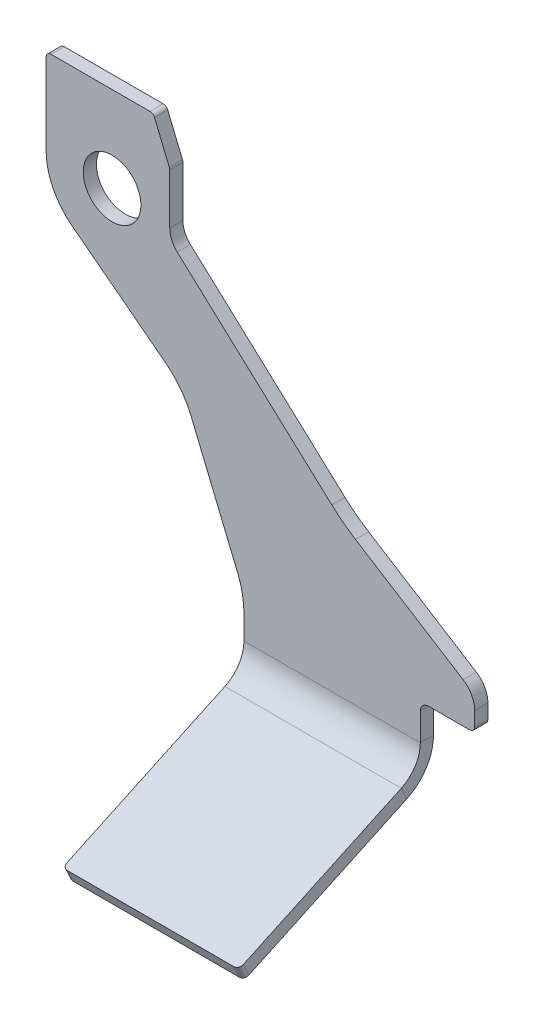
ISO-10303-21;
HEADER;
FILE_DESCRIPTION(('STEP AP214'),'2;1');
FILE_NAME('part.step','',(''),(''),'','','');
FILE_SCHEMA(('AUTOMOTIVE_DESIGN { 1 0 10303 214 1 1 1 1 }'));
ENDSEC;
DATA;
#1=APPLICATION_CONTEXT('core data for automotive mechanical design processes');
#2=APPLICATION_PROTOCOL_DEFINITION('international standard','automotive_design',2000,#1);
#3=PRODUCT_CONTEXT('',#1,'mechanical');
#4=PRODUCT('Part','Part','',(#3));
#5=PRODUCT_RELATED_PRODUCT_CATEGORY('part','',(#4));
#6=PRODUCT_DEFINITION_FORMATION('','',#4);
#7=PRODUCT_DEFINITION_CONTEXT('part definition',#1,'design');
#8=PRODUCT_DEFINITION('design','',#6,#7);
#9=PRODUCT_DEFINITION_SHAPE('','',#8);
#10=(LENGTH_UNIT() NAMED_UNIT(*) SI_UNIT(.MILLI.,.METRE.));
#11=(NAMED_UNIT(*) PLANE_ANGLE_UNIT() SI_UNIT($,.RADIAN.));
#12=(NAMED_UNIT(*) SI_UNIT($,.STERADIAN.) SOLID_ANGLE_UNIT());
#13=UNCERTAINTY_MEASURE_WITH_UNIT(LENGTH_MEASURE(1.E-05),#10,'distance_accuracy_value','');
#14=(GEOMETRIC_REPRESENTATION_CONTEXT(3) GLOBAL_UNCERTAINTY_ASSIGNED_CONTEXT((#13)) GLOBAL_UNIT_ASSIGNED_CONTEXT((#10,
#11,#12)) REPRESENTATION_CONTEXT('',''));
#15=CARTESIAN_POINT('',(0.,0.,0.));
#16=DIRECTION('',(0.,0.,1.));
#17=DIRECTION('',(1.,0.,0.));
#18=AXIS2_PLACEMENT_3D('',#15,#16,#17);
#19=CARTESIAN_POINT('',(83.,-269.056535875061,106.708664270019));
#20=DIRECTION('',(0.,-0.422618261740697,0.906307787036651));
#21=DIRECTION('',(1.,0.,0.));
#22=AXIS2_PLACEMENT_3D('',#19,#20,#21);
#23=PLANE('',#22);
#24=DIRECTION('',(1.,0.,0.));
#25=VECTOR('',#24,1.);
#26=CARTESIAN_POINT('',(83.,-261.806073578768,110.089610363945));
#27=LINE('',#26,#25);
#28=CARTESIAN_POINT('',(83.,-261.806073578768,110.089610363945));
#29=VERTEX_POINT('',#28);
#30=CARTESIAN_POINT('',(184.,-261.806073578767,110.089610363945));
#31=VERTEX_POINT('',#30);
#32=EDGE_CURVE('E11',#29,#31,#27,.T.);
#33=ORIENTED_EDGE('',*,*,#32,.F.);
#34=DIRECTION('',(0.,0.906307787036651,0.422618261740697));
#35=VECTOR('',#34,1.);
#36=CARTESIAN_POINT('',(83.,-269.056535875061,106.708664270019));
#37=LINE('',#36,#35);
#38=CARTESIAN_POINT('',(83.,-269.056535875061,106.708664270019));
#39=VERTEX_POINT('',#38);
#40=EDGE_CURVE('E88',#39,#29,#37,.T.);
#41=ORIENTED_EDGE('',*,*,#40,.F.);
#42=DIRECTION('',(1.,0.,0.));
#43=VECTOR('',#42,1.);
#44=CARTESIAN_POINT('',(83.,-269.056535875061,106.708664270019));
#45=LINE('',#44,#43);
#46=CARTESIAN_POINT('',(184.,-269.056535875061,106.708664270019));
#47=VERTEX_POINT('',#46);
#48=EDGE_CURVE('E432',#39,#47,#45,.T.);
#49=ORIENTED_EDGE('',*,*,#48,.T.);
#50=DIRECTION('',(0.,0.906307787036651,0.422618261740697));
#51=VECTOR('',#50,1.);
#52=CARTESIAN_POINT('',(184.,-269.056535875061,106.708664270019));
#53=LINE('',#52,#51);
#54=EDGE_CURVE('E85',#47,#31,#53,.T.);
#55=ORIENTED_EDGE('',*,*,#54,.T.);
#56=EDGE_LOOP('',(#33,#41,#49,#55));
#57=FACE_BOUND('',#56,.T.);
#58=ADVANCED_FACE('F39',(#57),#23,.T.);
#59=CARTESIAN_POINT('',(184.,-267.788681089839,103.989740908909));
#60=DIRECTION('',(0.,0.906307787036651,0.422618261740697));
#61=DIRECTION('',(1.,0.,0.));
#62=AXIS2_PLACEMENT_3D('',#59,#60,#61);
#63=CYLINDRICAL_SURFACE('',#62,2.99999999999996);
#64=CARTESIAN_POINT('',(184.,-260.538218793545,107.370687002835));
#65=DIRECTION('',(0.,-0.906307787036651,-0.422618261740697));
#66=DIRECTION('',(-1.,0.,0.));
#67=AXIS2_PLACEMENT_3D('',#64,#65,#66);
#68=CIRCLE('',#67,2.99999999999996);
#69=CARTESIAN_POINT('',(187.,-260.538218793545,107.370687002835));
#70=VERTEX_POINT('',#69);
#71=EDGE_CURVE('E429',#70,#31,#68,.T.);
#72=ORIENTED_EDGE('',*,*,#71,.T.);
#73=ORIENTED_EDGE('',*,*,#54,.F.);
#74=CARTESIAN_POINT('',(184.,-267.788681089839,103.989740908909));
#75=DIRECTION('',(0.,-0.906307787036651,-0.422618261740697));
#76=DIRECTION('',(-1.,0.,0.));
#77=AXIS2_PLACEMENT_3D('',#74,#75,#76);
#78=CIRCLE('',#77,2.99999999999996);
#79=CARTESIAN_POINT('',(187.,-267.788681089839,103.989740908909));
#80=VERTEX_POINT('',#79);
#81=EDGE_CURVE('E408',#80,#47,#78,.T.);
#82=ORIENTED_EDGE('',*,*,#81,.F.);
#83=DIRECTION('',(0.,0.906307787036651,0.422618261740697));
#84=VECTOR('',#83,1.);
#85=CARTESIAN_POINT('',(187.,-267.788681089839,103.989740908909));
#86=LINE('',#85,#84);
#87=EDGE_CURVE('E426',#80,#70,#86,.T.);
#88=ORIENTED_EDGE('',*,*,#87,.T.);
#89=EDGE_LOOP('',(#72,#73,#82,#88));
#90=FACE_BOUND('',#89,.T.);
#91=ADVANCED_FACE('F458',(#90),#63,.T.);
#92=CARTESIAN_POINT('',(83.,-267.788681089839,103.989740908909));
#93=DIRECTION('',(0.,0.906307787036651,0.422618261740697));
#94=DIRECTION('',(1.,0.,0.));
#95=AXIS2_PLACEMENT_3D('',#92,#93,#94);
#96=CYLINDRICAL_SURFACE('',#95,3.);
#97=CARTESIAN_POINT('',(83.,-260.538218793545,107.370687002835));
#98=DIRECTION('',(0.,-0.906307787036651,-0.422618261740697));
#99=DIRECTION('',(-1.,0.,0.));
#100=AXIS2_PLACEMENT_3D('',#97,#98,#99);
#101=CIRCLE('',#100,3.);
#102=CARTESIAN_POINT('',(80.,-260.538218793545,107.370687002835));
#103=VERTEX_POINT('',#102);
#104=EDGE_CURVE('E423',#29,#103,#101,.T.);
#105=ORIENTED_EDGE('',*,*,#104,.T.);
#106=DIRECTION('',(0.,0.906307787036651,0.422618261740697));
#107=VECTOR('',#106,1.);
#108=CARTESIAN_POINT('',(80.,-267.788681089839,103.989740908909));
#109=LINE('',#108,#107);
#110=CARTESIAN_POINT('',(80.,-267.788681089839,103.989740908909));
#111=VERTEX_POINT('',#110);
#112=EDGE_CURVE('E415',#111,#103,#109,.T.);
#113=ORIENTED_EDGE('',*,*,#112,.F.);
#114=CARTESIAN_POINT('',(83.,-267.788681089839,103.989740908909));
#115=DIRECTION('',(0.,-0.906307787036651,-0.422618261740697));
#116=DIRECTION('',(-1.,0.,0.));
#117=AXIS2_PLACEMENT_3D('',#114,#115,#116);
#118=CIRCLE('',#117,3.);
#119=EDGE_CURVE('E405',#39,#111,#118,.T.);
#120=ORIENTED_EDGE('',*,*,#119,.F.);
#121=ORIENTED_EDGE('',*,*,#40,.T.);
#122=EDGE_LOOP('',(#105,#113,#120,#121));
#123=FACE_BOUND('',#122,.T.);
#124=ADVANCED_FACE('F601',(#123),#96,.T.);
#125=CARTESIAN_POINT('',(80.,-205.640813943585,-29.286790281141));
#126=DIRECTION('',(-1.,0.,0.));
#127=DIRECTION('',(0.,-0.422618261740697,0.906307787036651));
#128=AXIS2_PLACEMENT_3D('',#125,#126,#127);
#129=PLANE('',#128);
#130=DIRECTION('',(0.,-0.422618261740697,0.906307787036651));
#131=VECTOR('',#130,1.);
#132=CARTESIAN_POINT('',(80.,-198.390351647292,-25.9058441872155));
#133=LINE('',#132,#131);
#134=CARTESIAN_POINT('',(80.,-215.855195707344,11.5476347651861));
#135=VERTEX_POINT('',#134);
#136=EDGE_CURVE('E49',#135,#103,#133,.T.);
#137=ORIENTED_EDGE('',*,*,#136,.F.);
#138=DIRECTION('',(0.,-0.906307787036648,-0.422618261740704));
#139=VECTOR('',#138,1.);
#140=CARTESIAN_POINT('',(80.,-223.105658003637,8.1666886712603));
#141=LINE('',#140,#139);
#142=CARTESIAN_POINT('',(80.,-223.105658003637,8.1666886712605));
#143=VERTEX_POINT('',#142);
#144=EDGE_CURVE('E419',#135,#143,#141,.T.);
#145=ORIENTED_EDGE('',*,*,#144,.T.);
#146=DIRECTION('',(0.,-0.422618261740697,0.906307787036651));
#147=VECTOR('',#146,1.);
#148=CARTESIAN_POINT('',(80.,-205.640813943585,-29.286790281141));
#149=LINE('',#148,#147);
#150=EDGE_CURVE('E417',#143,#111,#149,.T.);
#151=ORIENTED_EDGE('',*,*,#150,.T.);
#152=ORIENTED_EDGE('',*,*,#112,.T.);
#153=EDGE_LOOP('',(#137,#145,#151,#152));
#154=FACE_BOUND('',#153,.T.);
#155=ADVANCED_FACE('F476',(#154),#129,.T.);
#156=CARTESIAN_POINT('',(0.,-128.324654715409,-195.091828813186));
#157=DIRECTION('',(0.,-0.906307787036651,-0.422618261740697));
#158=DIRECTION('',(-1.,0.,0.));
#159=AXIS2_PLACEMENT_3D('',#156,#157,#158);
#160=PLANE('',#159);
#161=ORIENTED_EDGE('',*,*,#150,.F.);
#162=DIRECTION('',(1.,0.,0.));
#163=VECTOR('',#162,1.);
#164=CARTESIAN_POINT('',(0.,-223.105658003637,8.16668867126041));
#165=LINE('',#164,#163);
#166=CARTESIAN_POINT('',(187.,-223.105658003637,8.16668867126041));
#167=VERTEX_POINT('',#166);
#168=EDGE_CURVE('E412',#143,#167,#165,.T.);
#169=ORIENTED_EDGE('',*,*,#168,.T.);
#170=DIRECTION('',(0.,-0.422618261740697,0.906307787036651));
#171=VECTOR('',#170,1.);
#172=CARTESIAN_POINT('',(187.,-204.818560090475,-31.050119359552));
#173=LINE('',#172,#171);
#174=EDGE_CURVE('E410',#167,#80,#173,.T.);
#175=ORIENTED_EDGE('',*,*,#174,.T.);
#176=ORIENTED_EDGE('',*,*,#81,.T.);
#177=ORIENTED_EDGE('',*,*,#48,.F.);
#178=ORIENTED_EDGE('',*,*,#119,.T.);
#179=EDGE_LOOP('',(#161,#169,#175,#176,#177,#178));
#180=FACE_BOUND('',#179,.T.);
#181=ADVANCED_FACE('F463',(#180),#160,.T.);
#182=CARTESIAN_POINT('',(187.,-204.818560090475,-31.050119359552));
#183=DIRECTION('',(-1.,0.,0.));
#184=DIRECTION('',(0.,0.906307787036651,0.422618261740697));
#185=AXIS2_PLACEMENT_3D('',#182,#183,#184);
#186=PLANE('',#185);
#187=DIRECTION('',(0.,-0.906307787036648,-0.422618261740704));
#188=VECTOR('',#187,1.);
#189=CARTESIAN_POINT('',(187.,-223.105658003637,8.1666886712603));
#190=LINE('',#189,#188);
#191=CARTESIAN_POINT('',(187.,-215.855195707344,11.5476347651861));
#192=VERTEX_POINT('',#191);
#193=EDGE_CURVE('E433',#192,#167,#190,.T.);
#194=ORIENTED_EDGE('',*,*,#193,.F.);
#195=DIRECTION('',(0.,-0.422618261740697,0.906307787036651));
#196=VECTOR('',#195,1.);
#197=CARTESIAN_POINT('',(187.,-197.568097794182,-27.6691732656264));
#198=LINE('',#197,#196);
#199=EDGE_CURVE('E403',#192,#70,#198,.T.);
#200=ORIENTED_EDGE('',*,*,#199,.T.);
#201=ORIENTED_EDGE('',*,*,#87,.F.);
#202=ORIENTED_EDGE('',*,*,#174,.F.);
#203=EDGE_LOOP('',(#194,#200,#201,#202));
#204=FACE_BOUND('',#203,.T.);
#205=ADVANCED_FACE('F454',(#204),#186,.F.);
#206=CARTESIAN_POINT('',(0.,-121.074192419115,-191.71088271926));
#207=DIRECTION('',(0.,-0.906307787036651,-0.422618261740697));
#208=DIRECTION('',(-1.,0.,0.));
#209=AXIS2_PLACEMENT_3D('',#206,#207,#208);
#210=PLANE('',#209);
#211=DIRECTION('',(1.,0.,0.));
#212=VECTOR('',#211,1.);
#213=CARTESIAN_POINT('',(0.,-215.855195707344,11.5476347651861));
#214=LINE('',#213,#212);
#215=EDGE_CURVE('E43',#135,#192,#214,.T.);
#216=ORIENTED_EDGE('',*,*,#215,.F.);
#217=ORIENTED_EDGE('',*,*,#136,.T.);
#218=ORIENTED_EDGE('',*,*,#104,.F.);
#219=ORIENTED_EDGE('',*,*,#32,.T.);
#220=ORIENTED_EDGE('',*,*,#71,.F.);
#221=ORIENTED_EDGE('',*,*,#199,.F.);
#222=EDGE_LOOP('',(#216,#217,#218,#219,#220,#221));
#223=FACE_BOUND('',#222,.T.);
#224=ADVANCED_FACE('F41',(#223),#210,.F.);
#225=CARTESIAN_POINT('',(187.,-181.,-8.));
#226=DIRECTION('',(-1.,0.,0.));
#227=DIRECTION('',(0.,0.,1.));
#228=AXIS2_PLACEMENT_3D('',#225,#226,#227);
#229=PLANE('',#228);
#230=DIRECTION('',(0.,-1.,0.));
#231=VECTOR('',#230,1.);
#232=CARTESIAN_POINT('',(187.,-181.,0.));
#233=LINE('',#232,#231);
#234=CARTESIAN_POINT('',(187.,-181.,0.));
#235=VERTEX_POINT('',#234);
#236=CARTESIAN_POINT('',(187.,-197.729039966611,0.));
#237=VERTEX_POINT('',#236);
#238=EDGE_CURVE('E325',#235,#237,#233,.T.);
#239=ORIENTED_EDGE('',*,*,#238,.T.);
#240=DIRECTION('',(0.,0.,-1.));
#241=VECTOR('',#240,1.);
#242=CARTESIAN_POINT('',(187.,-197.729039966611,-8.00000000000012));
#243=LINE('',#242,#241);
#244=CARTESIAN_POINT('',(187.,-197.729039966611,-8.));
#245=VERTEX_POINT('',#244);
#246=EDGE_CURVE('E383',#237,#245,#243,.T.);
#247=ORIENTED_EDGE('',*,*,#246,.T.);
#248=DIRECTION('',(0.,-1.,0.));
#249=VECTOR('',#248,1.);
#250=CARTESIAN_POINT('',(187.,-181.,-8.));
#251=LINE('',#250,#249);
#252=CARTESIAN_POINT('',(187.,-181.,-8.));
#253=VERTEX_POINT('',#252);
#254=EDGE_CURVE('E395',#253,#245,#251,.T.);
#255=ORIENTED_EDGE('',*,*,#254,.F.);
#256=DIRECTION('',(0.,0.,1.));
#257=VECTOR('',#256,1.);
#258=CARTESIAN_POINT('',(187.,-181.,-8.));
#259=LINE('',#258,#257);
#260=EDGE_CURVE('E342',#253,#235,#259,.T.);
#261=ORIENTED_EDGE('',*,*,#260,.T.);
#262=EDGE_LOOP('',(#239,#247,#255,#261));
#263=FACE_BOUND('',#262,.T.);
#264=ADVANCED_FACE('F494',(#263),#229,.F.);
#265=CARTESIAN_POINT('',(0.,0.,0.));
#266=DIRECTION('',(0.,0.,-1.));
#267=DIRECTION('',(-1.,0.,0.));
#268=AXIS2_PLACEMENT_3D('',#265,#266,#267);
#269=PLANE('',#268);
#270=CARTESIAN_POINT('',(0.,0.,0.));
#271=DIRECTION('',(0.,0.,1.));
#272=DIRECTION('',(1.,0.,0.));
#273=AXIS2_PLACEMENT_3D('',#270,#271,#272);
#274=CIRCLE('',#273,17.5);
#275=CARTESIAN_POINT('',(17.5,0.,0.));
#276=VERTEX_POINT('',#275);
#277=EDGE_CURVE('E784',#276,#276,#274,.T.);
#278=ORIENTED_EDGE('',*,*,#277,.F.);
#279=EDGE_LOOP('',(#278));
#280=FACE_BOUND('',#279,.T.);
#281=DIRECTION('',(0.,-1.,0.));
#282=VECTOR('',#281,1.);
#283=CARTESIAN_POINT('',(80.,-182.945618368983,0.));
#284=LINE('',#283,#282);
#285=CARTESIAN_POINT('',(80.,-182.945618368983,0.));
#286=VERTEX_POINT('',#285);
#287=CARTESIAN_POINT('',(80.,-197.729039966611,0.));
#288=VERTEX_POINT('',#287);
#289=EDGE_CURVE('E329',#286,#288,#284,.T.);
#290=ORIENTED_EDGE('',*,*,#289,.T.);
#291=DIRECTION('',(1.,0.,0.));
#292=VECTOR('',#291,1.);
#293=CARTESIAN_POINT('',(0.,-197.729039966611,0.));
#294=LINE('',#293,#292);
#295=EDGE_CURVE('E380',#288,#237,#294,.T.);
#296=ORIENTED_EDGE('',*,*,#295,.T.);
#297=ORIENTED_EDGE('',*,*,#238,.F.);
#298=CARTESIAN_POINT('',(192.,-181.,0.));
#299=DIRECTION('',(0.,0.,1.));
#300=DIRECTION('',(1.,0.,0.));
#301=AXIS2_PLACEMENT_3D('',#298,#299,#300);
#302=CIRCLE('',#301,5.);
#303=CARTESIAN_POINT('',(192.,-176.,0.));
#304=VERTEX_POINT('',#303);
#305=EDGE_CURVE('E323',#304,#235,#302,.T.);
#306=ORIENTED_EDGE('',*,*,#305,.F.);
#307=DIRECTION('',(-1.,0.,0.));
#308=VECTOR('',#307,1.);
#309=CARTESIAN_POINT('',(217.,-176.,0.));
#310=LINE('',#309,#308);
#311=CARTESIAN_POINT('',(217.,-176.,0.));
#312=VERTEX_POINT('',#311);
#313=EDGE_CURVE('E321',#312,#304,#310,.T.);
#314=ORIENTED_EDGE('',*,*,#313,.F.);
#315=CARTESIAN_POINT('',(217.,-173.,0.));
#316=DIRECTION('',(0.,0.,1.));
#317=DIRECTION('',(1.,0.,0.));
#318=AXIS2_PLACEMENT_3D('',#315,#316,#317);
#319=CIRCLE('',#318,3.);
#320=CARTESIAN_POINT('',(220.,-173.,0.));
#321=VERTEX_POINT('',#320);
#322=EDGE_CURVE('E318',#312,#321,#319,.T.);
#323=ORIENTED_EDGE('',*,*,#322,.T.);
#324=DIRECTION('',(0.,1.,0.));
#325=VECTOR('',#324,1.);
#326=CARTESIAN_POINT('',(220.,-173.,0.));
#327=LINE('',#326,#325);
#328=CARTESIAN_POINT('',(220.,-164.288637003599,0.));
#329=VERTEX_POINT('',#328);
#330=EDGE_CURVE('E315',#321,#329,#327,.T.);
#331=ORIENTED_EDGE('',*,*,#330,.T.);
#332=CARTESIAN_POINT('',(205.,-164.288637003599,0.));
#333=DIRECTION('',(0.,0.,-1.));
#334=DIRECTION('',(-1.,0.,0.));
#335=AXIS2_PLACEMENT_3D('',#332,#333,#334);
#336=CIRCLE('',#335,15.);
#337=CARTESIAN_POINT('',(212.982517700379,-151.589053893783,0.));
#338=VERTEX_POINT('',#337);
#339=EDGE_CURVE('E312',#338,#329,#336,.T.);
#340=ORIENTED_EDGE('',*,*,#339,.F.);
#341=DIRECTION('',(0.846638873987745,-0.532167846691966,0.));
#342=VECTOR('',#341,1.);
#343=CARTESIAN_POINT('',(147.666248083662,-110.533511059845,0.));
#344=LINE('',#343,#342);
#345=CARTESIAN_POINT('',(147.666248083662,-110.533511059845,0.));
#346=VERTEX_POINT('',#345);
#347=EDGE_CURVE('E310',#346,#338,#344,.T.);
#348=ORIENTED_EDGE('',*,*,#347,.F.);
#349=CARTESIAN_POINT('',(200.883032752858,-25.869623661071,0.));
#350=DIRECTION('',(0.,0.,-1.));
#351=DIRECTION('',(-1.,0.,0.));
#352=AXIS2_PLACEMENT_3D('',#349,#350,#351);
#353=CIRCLE('',#352,100.);
#354=CARTESIAN_POINT('',(133.324011991292,-99.5973573420837,0.));
#355=VERTEX_POINT('',#354);
#356=EDGE_CURVE('E307',#346,#355,#353,.T.);
#357=ORIENTED_EDGE('',*,*,#356,.T.);
#358=DIRECTION('',(-0.737277336810126,0.675590207615658,0.));
#359=VECTOR('',#358,1.);
#360=CARTESIAN_POINT('',(133.324011991292,-99.5973573420836,0.));
#361=LINE('',#360,#359);
#362=CARTESIAN_POINT('',(39.5417370933808,-13.661735282856,0.));
#363=VERTEX_POINT('',#362);
#364=EDGE_CURVE('E304',#355,#363,#361,.T.);
#365=ORIENTED_EDGE('',*,*,#364,.T.);
#366=CARTESIAN_POINT('',(49.,-3.33985256751428,0.));
#367=DIRECTION('',(0.,0.,-1.));
#368=DIRECTION('',(-1.,0.,0.));
#369=AXIS2_PLACEMENT_3D('',#366,#367,#368);
#370=CIRCLE('',#369,14.);
#371=CARTESIAN_POINT('',(35.,-3.33985256751428,0.));
#372=VERTEX_POINT('',#371);
#373=EDGE_CURVE('E301',#363,#372,#370,.T.);
#374=ORIENTED_EDGE('',*,*,#373,.T.);
#375=DIRECTION('',(0.,1.,0.));
#376=VECTOR('',#375,1.);
#377=CARTESIAN_POINT('',(35.,-3.33985256751428,0.));
#378=LINE('',#377,#376);
#379=CARTESIAN_POINT('',(35.,27.2611272741301,0.));
#380=VERTEX_POINT('',#379);
#381=EDGE_CURVE('E298',#372,#380,#378,.T.);
#382=ORIENTED_EDGE('',*,*,#381,.T.);
#383=CARTESIAN_POINT('',(32.,27.2611272741301,0.));
#384=DIRECTION('',(0.,0.,-1.));
#385=DIRECTION('',(-1.,0.,0.));
#386=AXIS2_PLACEMENT_3D('',#383,#384,#385);
#387=CIRCLE('',#386,3.);
#388=CARTESIAN_POINT('',(34.7716385975339,28.4091775712254,0.));
#389=VERTEX_POINT('',#388);
#390=EDGE_CURVE('E295',#389,#380,#387,.T.);
#391=ORIENTED_EDGE('',*,*,#390,.F.);
#392=DIRECTION('',(-0.38268343236509,0.923879532511287,0.));
#393=VECTOR('',#392,1.);
#394=CARTESIAN_POINT('',(34.7716385975339,28.4091775712254,0.));
#395=LINE('',#394,#393);
#396=CARTESIAN_POINT('',(25.767102683776,50.1480502970953,0.));
#397=VERTEX_POINT('',#396);
#398=EDGE_CURVE('E292',#389,#397,#395,.T.);
#399=ORIENTED_EDGE('',*,*,#398,.T.);
#400=CARTESIAN_POINT('',(22.9954640862421,49.,0.));
#401=DIRECTION('',(0.,0.,1.));
#402=DIRECTION('',(1.,0.,0.));
#403=AXIS2_PLACEMENT_3D('',#400,#401,#402);
#404=CIRCLE('',#403,2.99999999999999);
#405=CARTESIAN_POINT('',(22.9954640862421,52.,0.));
#406=VERTEX_POINT('',#405);
#407=EDGE_CURVE('E289',#397,#406,#404,.T.);
#408=ORIENTED_EDGE('',*,*,#407,.T.);
#409=DIRECTION('',(-1.,0.,0.));
#410=VECTOR('',#409,1.);
#411=CARTESIAN_POINT('',(22.9954640862421,52.,0.));
#412=LINE('',#411,#410);
#413=CARTESIAN_POINT('',(-37.,52.,0.));
#414=VERTEX_POINT('',#413);
#415=EDGE_CURVE('E286',#406,#414,#412,.T.);
#416=ORIENTED_EDGE('',*,*,#415,.T.);
#417=CARTESIAN_POINT('',(-37.,49.,0.));
#418=DIRECTION('',(0.,0.,-1.));
#419=DIRECTION('',(-1.,0.,0.));
#420=AXIS2_PLACEMENT_3D('',#417,#418,#419);
#421=CIRCLE('',#420,3.);
#422=CARTESIAN_POINT('',(-40.,49.,0.));
#423=VERTEX_POINT('',#422);
#424=EDGE_CURVE('E283',#423,#414,#421,.T.);
#425=ORIENTED_EDGE('',*,*,#424,.F.);
#426=DIRECTION('',(0.,1.,0.));
#427=VECTOR('',#426,1.);
#428=CARTESIAN_POINT('',(-40.,0.,0.));
#429=LINE('',#428,#427);
#430=CARTESIAN_POINT('',(-40.,0.,0.));
#431=VERTEX_POINT('',#430);
#432=EDGE_CURVE('E280',#431,#423,#429,.T.);
#433=ORIENTED_EDGE('',*,*,#432,.F.);
#434=CARTESIAN_POINT('',(0.,0.,0.));
#435=DIRECTION('',(0.,0.,-1.));
#436=DIRECTION('',(-1.,0.,0.));
#437=AXIS2_PLACEMENT_3D('',#434,#435,#436);
#438=CIRCLE('',#437,40.);
#439=CARTESIAN_POINT('',(-24.3504571603489,-31.7341336116493,0.));
#440=VERTEX_POINT('',#439);
#441=EDGE_CURVE('E278',#440,#431,#438,.T.);
#442=ORIENTED_EDGE('',*,*,#441,.F.);
#443=DIRECTION('',(0.793353340291233,-0.608761429008723,0.));
#444=VECTOR('',#443,1.);
#445=CARTESIAN_POINT('',(-24.3504571603489,-31.7341336116493,0.));
#446=LINE('',#445,#444);
#447=CARTESIAN_POINT('',(32.2131212981815,-75.1368938995454,0.));
#448=VERTEX_POINT('',#447);
#449=EDGE_CURVE('E333',#440,#448,#446,.T.);
#450=ORIENTED_EDGE('',*,*,#449,.T.);
#451=CARTESIAN_POINT('',(1.7750498477453,-114.804560914107,0.));
#452=DIRECTION('',(0.,0.,-1.));
#453=DIRECTION('',(-1.,0.,0.));
#454=AXIS2_PLACEMENT_3D('',#451,#452,#453);
#455=CIRCLE('',#454,50.);
#456=CARTESIAN_POINT('',(47.9690264733095,-95.6703892958521,0.));
#457=VERTEX_POINT('',#456);
#458=EDGE_CURVE('E331',#448,#457,#455,.T.);
#459=ORIENTED_EDGE('',*,*,#458,.T.);
#460=DIRECTION('',(0.382683432365098,-0.923879532511283,0.));
#461=VECTOR('',#460,1.);
#462=CARTESIAN_POINT('',(47.9690264733095,-95.6703892958521,0.));
#463=LINE('',#462,#461);
#464=CARTESIAN_POINT('',(76.1939766255642,-163.811446750728,0.));
#465=VERTEX_POINT('',#464);
#466=EDGE_CURVE('E252',#457,#465,#463,.T.);
#467=ORIENTED_EDGE('',*,*,#466,.T.);
#468=CARTESIAN_POINT('',(30.,-182.945618368983,0.));
#469=DIRECTION('',(0.,0.,-1.));
#470=DIRECTION('',(-1.,0.,0.));
#471=AXIS2_PLACEMENT_3D('',#468,#469,#470);
#472=CIRCLE('',#471,50.);
#473=EDGE_CURVE('E326',#465,#286,#472,.T.);
#474=ORIENTED_EDGE('',*,*,#473,.T.);
#475=EDGE_LOOP('',(#290,#296,#297,#306,#314,#323,#331,#340,#348,#357,#365,#374,#382,#391,#399,
#408,#416,#425,#433,#442,#450,#459,#467,#474));
#476=FACE_BOUND('',#475,.T.);
#477=ADVANCED_FACE('F488',(#280,#476),#269,.F.);
#478=CARTESIAN_POINT('',(0.,0.,-8.));
#479=DIRECTION('',(0.,0.,1.));
#480=DIRECTION('',(1.,0.,0.));
#481=AXIS2_PLACEMENT_3D('',#478,#479,#480);
#482=CYLINDRICAL_SURFACE('',#481,40.);
#483=ORIENTED_EDGE('',*,*,#441,.T.);
#484=DIRECTION('',(0.,0.,1.));
#485=VECTOR('',#484,1.);
#486=CARTESIAN_POINT('',(-40.,0.,-8.));
#487=LINE('',#486,#485);
#488=CARTESIAN_POINT('',(-40.,0.,-8.));
#489=VERTEX_POINT('',#488);
#490=EDGE_CURVE('E378',#489,#431,#487,.T.);
#491=ORIENTED_EDGE('',*,*,#490,.F.);
#492=CARTESIAN_POINT('',(0.,0.,-8.));
#493=DIRECTION('',(0.,0.,-1.));
#494=DIRECTION('',(-1.,0.,0.));
#495=AXIS2_PLACEMENT_3D('',#492,#493,#494);
#496=CIRCLE('',#495,40.);
#497=CARTESIAN_POINT('',(-24.3504571603489,-31.7341336116493,-8.));
#498=VERTEX_POINT('',#497);
#499=EDGE_CURVE('E336',#498,#489,#496,.T.);
#500=ORIENTED_EDGE('',*,*,#499,.F.);
#501=DIRECTION('',(0.,0.,1.));
#502=VECTOR('',#501,1.);
#503=CARTESIAN_POINT('',(-24.3504571603489,-31.7341336116493,-8.));
#504=LINE('',#503,#502);
#505=EDGE_CURVE('E104',#498,#440,#504,.T.);
#506=ORIENTED_EDGE('',*,*,#505,.T.);
#507=EDGE_LOOP('',(#483,#491,#500,#506));
#508=FACE_BOUND('',#507,.T.);
#509=ADVANCED_FACE('F585',(#508),#482,.T.);
#510=CARTESIAN_POINT('',(-40.,0.,-8.));
#511=DIRECTION('',(1.,0.,0.));
#512=DIRECTION('',(0.,0.,-1.));
#513=AXIS2_PLACEMENT_3D('',#510,#511,#512);
#514=PLANE('',#513);
#515=ORIENTED_EDGE('',*,*,#432,.T.);
#516=DIRECTION('',(0.,0.,1.));
#517=VECTOR('',#516,1.);
#518=CARTESIAN_POINT('',(-40.,49.,-8.));
#519=LINE('',#518,#517);
#520=CARTESIAN_POINT('',(-40.,49.,-8.));
#521=VERTEX_POINT('',#520);
#522=EDGE_CURVE('E375',#521,#423,#519,.T.);
#523=ORIENTED_EDGE('',*,*,#522,.F.);
#524=DIRECTION('',(0.,1.,0.));
#525=VECTOR('',#524,1.);
#526=CARTESIAN_POINT('',(-40.,0.,-8.));
#527=LINE('',#526,#525);
#528=EDGE_CURVE('E186',#489,#521,#527,.T.);
#529=ORIENTED_EDGE('',*,*,#528,.F.);
#530=ORIENTED_EDGE('',*,*,#490,.T.);
#531=EDGE_LOOP('',(#515,#523,#529,#530));
#532=FACE_BOUND('',#531,.T.);
#533=ADVANCED_FACE('F581',(#532),#514,.F.);
#534=CARTESIAN_POINT('',(-37.,49.,-8.));
#535=DIRECTION('',(0.,0.,1.));
#536=DIRECTION('',(1.,0.,0.));
#537=AXIS2_PLACEMENT_3D('',#534,#535,#536);
#538=CYLINDRICAL_SURFACE('',#537,3.);
#539=ORIENTED_EDGE('',*,*,#424,.T.);
#540=DIRECTION('',(0.,0.,1.));
#541=VECTOR('',#540,1.);
#542=CARTESIAN_POINT('',(-37.,52.,-8.));
#543=LINE('',#542,#541);
#544=CARTESIAN_POINT('',(-37.,52.,-8.));
#545=VERTEX_POINT('',#544);
#546=EDGE_CURVE('E373',#545,#414,#543,.T.);
#547=ORIENTED_EDGE('',*,*,#546,.F.);
#548=CARTESIAN_POINT('',(-37.,49.,-8.));
#549=DIRECTION('',(0.,0.,-1.));
#550=DIRECTION('',(-1.,0.,0.));
#551=AXIS2_PLACEMENT_3D('',#548,#549,#550);
#552=CIRCLE('',#551,3.);
#553=EDGE_CURVE('E580',#521,#545,#552,.T.);
#554=ORIENTED_EDGE('',*,*,#553,.F.);
#555=ORIENTED_EDGE('',*,*,#522,.T.);
#556=EDGE_LOOP('',(#539,#547,#554,#555));
#557=FACE_BOUND('',#556,.T.);
#558=ADVANCED_FACE('F579',(#557),#538,.T.);
#559=CARTESIAN_POINT('',(22.9954640862421,52.,-8.));
#560=DIRECTION('',(0.,1.,0.));
#561=DIRECTION('',(-1.,0.,0.));
#562=AXIS2_PLACEMENT_3D('',#559,#560,#561);
#563=PLANE('',#562);
#564=ORIENTED_EDGE('',*,*,#415,.F.);
#565=DIRECTION('',(0.,0.,1.));
#566=VECTOR('',#565,1.);
#567=CARTESIAN_POINT('',(22.9954640862421,52.,-8.));
#568=LINE('',#567,#566);
#569=CARTESIAN_POINT('',(22.9954640862421,52.,-8.));
#570=VERTEX_POINT('',#569);
#571=EDGE_CURVE('E371',#570,#406,#568,.T.);
#572=ORIENTED_EDGE('',*,*,#571,.F.);
#573=DIRECTION('',(-1.,0.,0.));
#574=VECTOR('',#573,1.);
#575=CARTESIAN_POINT('',(22.9954640862421,52.,-8.));
#576=LINE('',#575,#574);
#577=EDGE_CURVE('E576',#570,#545,#576,.T.);
#578=ORIENTED_EDGE('',*,*,#577,.T.);
#579=ORIENTED_EDGE('',*,*,#546,.T.);
#580=EDGE_LOOP('',(#564,#572,#578,#579));
#581=FACE_BOUND('',#580,.T.);
#582=ADVANCED_FACE('F572',(#581),#563,.T.);
#583=CARTESIAN_POINT('',(22.9954640862421,49.,-8.));
#584=DIRECTION('',(0.,0.,1.));
#585=DIRECTION('',(1.,0.,0.));
#586=AXIS2_PLACEMENT_3D('',#583,#584,#585);
#587=CYLINDRICAL_SURFACE('',#586,2.99999999999999);
#588=ORIENTED_EDGE('',*,*,#407,.F.);
#589=DIRECTION('',(0.,0.,1.));
#590=VECTOR('',#589,1.);
#591=CARTESIAN_POINT('',(25.767102683776,50.1480502970953,-8.));
#592=LINE('',#591,#590);
#593=CARTESIAN_POINT('',(25.767102683776,50.1480502970953,-8.));
#594=VERTEX_POINT('',#593);
#595=EDGE_CURVE('E369',#594,#397,#592,.T.);
#596=ORIENTED_EDGE('',*,*,#595,.F.);
#597=CARTESIAN_POINT('',(22.9954640862421,49.,-8.));
#598=DIRECTION('',(0.,0.,1.));
#599=DIRECTION('',(1.,0.,0.));
#600=AXIS2_PLACEMENT_3D('',#597,#598,#599);
#601=CIRCLE('',#600,2.99999999999999);
#602=EDGE_CURVE('E792',#594,#570,#601,.T.);
#603=ORIENTED_EDGE('',*,*,#602,.T.);
#604=ORIENTED_EDGE('',*,*,#571,.T.);
#605=EDGE_LOOP('',(#588,#596,#603,#604));
#606=FACE_BOUND('',#605,.T.);
#607=ADVANCED_FACE('F568',(#606),#587,.T.);
#608=CARTESIAN_POINT('',(34.7716385975339,28.4091775712254,-8.));
#609=DIRECTION('',(0.923879532511287,0.38268343236509,0.));
#610=DIRECTION('',(-0.38268343236509,0.923879532511287,0.));
#611=AXIS2_PLACEMENT_3D('',#608,#609,#610);
#612=PLANE('',#611);
#613=ORIENTED_EDGE('',*,*,#398,.F.);
#614=DIRECTION('',(0.,0.,1.));
#615=VECTOR('',#614,1.);
#616=CARTESIAN_POINT('',(34.7716385975339,28.4091775712254,-8.));
#617=LINE('',#616,#615);
#618=CARTESIAN_POINT('',(34.7716385975339,28.4091775712254,-8.));
#619=VERTEX_POINT('',#618);
#620=EDGE_CURVE('E367',#619,#389,#617,.T.);
#621=ORIENTED_EDGE('',*,*,#620,.F.);
#622=DIRECTION('',(-0.38268343236509,0.923879532511287,0.));
#623=VECTOR('',#622,1.);
#624=CARTESIAN_POINT('',(34.7716385975339,28.4091775712254,-8.));
#625=LINE('',#624,#623);
#626=EDGE_CURVE('E564',#619,#594,#625,.T.);
#627=ORIENTED_EDGE('',*,*,#626,.T.);
#628=ORIENTED_EDGE('',*,*,#595,.T.);
#629=EDGE_LOOP('',(#613,#621,#627,#628));
#630=FACE_BOUND('',#629,.T.);
#631=ADVANCED_FACE('F560',(#630),#612,.T.);
#632=CARTESIAN_POINT('',(32.,27.2611272741301,-8.));
#633=DIRECTION('',(0.,0.,1.));
#634=DIRECTION('',(1.,0.,0.));
#635=AXIS2_PLACEMENT_3D('',#632,#633,#634);
#636=CYLINDRICAL_SURFACE('',#635,3.);
#637=ORIENTED_EDGE('',*,*,#390,.T.);
#638=DIRECTION('',(0.,0.,1.));
#639=VECTOR('',#638,1.);
#640=CARTESIAN_POINT('',(35.,27.2611272741301,-8.));
#641=LINE('',#640,#639);
#642=CARTESIAN_POINT('',(35.,27.2611272741301,-8.));
#643=VERTEX_POINT('',#642);
#644=EDGE_CURVE('E365',#643,#380,#641,.T.);
#645=ORIENTED_EDGE('',*,*,#644,.F.);
#646=CARTESIAN_POINT('',(32.,27.2611272741301,-8.));
#647=DIRECTION('',(0.,0.,-1.));
#648=DIRECTION('',(-1.,0.,0.));
#649=AXIS2_PLACEMENT_3D('',#646,#647,#648);
#650=CIRCLE('',#649,3.);
#651=EDGE_CURVE('E795',#619,#643,#650,.T.);
#652=ORIENTED_EDGE('',*,*,#651,.F.);
#653=ORIENTED_EDGE('',*,*,#620,.T.);
#654=EDGE_LOOP('',(#637,#645,#652,#653));
#655=FACE_BOUND('',#654,.T.);
#656=ADVANCED_FACE('F557',(#655),#636,.T.);
#657=CARTESIAN_POINT('',(35.,-3.33985256751428,-8.));
#658=DIRECTION('',(1.,0.,0.));
#659=DIRECTION('',(0.,1.,0.));
#660=AXIS2_PLACEMENT_3D('',#657,#658,#659);
#661=PLANE('',#660);
#662=ORIENTED_EDGE('',*,*,#381,.F.);
#663=DIRECTION('',(0.,0.,1.));
#664=VECTOR('',#663,1.);
#665=CARTESIAN_POINT('',(35.,-3.33985256751428,-8.));
#666=LINE('',#665,#664);
#667=CARTESIAN_POINT('',(35.,-3.33985256751428,-8.));
#668=VERTEX_POINT('',#667);
#669=EDGE_CURVE('E363',#668,#372,#666,.T.);
#670=ORIENTED_EDGE('',*,*,#669,.F.);
#671=DIRECTION('',(0.,1.,0.));
#672=VECTOR('',#671,1.);
#673=CARTESIAN_POINT('',(35.,-3.33985256751428,-8.));
#674=LINE('',#673,#672);
#675=EDGE_CURVE('E554',#668,#643,#674,.T.);
#676=ORIENTED_EDGE('',*,*,#675,.T.);
#677=ORIENTED_EDGE('',*,*,#644,.T.);
#678=EDGE_LOOP('',(#662,#670,#676,#677));
#679=FACE_BOUND('',#678,.T.);
#680=ADVANCED_FACE('F552',(#679),#661,.T.);
#681=CARTESIAN_POINT('',(49.,-3.33985256751428,-8.));
#682=DIRECTION('',(0.,0.,1.));
#683=DIRECTION('',(1.,0.,0.));
#684=AXIS2_PLACEMENT_3D('',#681,#682,#683);
#685=CYLINDRICAL_SURFACE('',#684,14.);
#686=ORIENTED_EDGE('',*,*,#373,.F.);
#687=DIRECTION('',(0.,0.,1.));
#688=VECTOR('',#687,1.);
#689=CARTESIAN_POINT('',(39.5417370933808,-13.661735282856,-8.));
#690=LINE('',#689,#688);
#691=CARTESIAN_POINT('',(39.5417370933808,-13.661735282856,-8.));
#692=VERTEX_POINT('',#691);
#693=EDGE_CURVE('E361',#692,#363,#690,.T.);
#694=ORIENTED_EDGE('',*,*,#693,.F.);
#695=CARTESIAN_POINT('',(49.,-3.33985256751428,-8.));
#696=DIRECTION('',(0.,0.,-1.));
#697=DIRECTION('',(-1.,0.,0.));
#698=AXIS2_PLACEMENT_3D('',#695,#696,#697);
#699=CIRCLE('',#698,14.);
#700=EDGE_CURVE('E548',#692,#668,#699,.T.);
#701=ORIENTED_EDGE('',*,*,#700,.T.);
#702=ORIENTED_EDGE('',*,*,#669,.T.);
#703=EDGE_LOOP('',(#686,#694,#701,#702));
#704=FACE_BOUND('',#703,.T.);
#705=ADVANCED_FACE('F545',(#704),#685,.F.);
#706=CARTESIAN_POINT('',(133.324011991292,-99.5973573420836,-8.));
#707=DIRECTION('',(0.675590207615658,0.737277336810126,0.));
#708=DIRECTION('',(-0.737277336810126,0.675590207615658,0.));
#709=AXIS2_PLACEMENT_3D('',#706,#707,#708);
#710=PLANE('',#709);
#711=ORIENTED_EDGE('',*,*,#364,.F.);
#712=DIRECTION('',(0.,0.,1.));
#713=VECTOR('',#712,1.);
#714=CARTESIAN_POINT('',(133.324011991292,-99.5973573420837,-8.));
#715=LINE('',#714,#713);
#716=CARTESIAN_POINT('',(133.324011991292,-99.5973573420837,-8.));
#717=VERTEX_POINT('',#716);
#718=EDGE_CURVE('E359',#717,#355,#715,.T.);
#719=ORIENTED_EDGE('',*,*,#718,.F.);
#720=DIRECTION('',(-0.737277336810126,0.675590207615658,0.));
#721=VECTOR('',#720,1.);
#722=CARTESIAN_POINT('',(133.324011991292,-99.5973573420836,-8.));
#723=LINE('',#722,#721);
#724=EDGE_CURVE('E799',#717,#692,#723,.T.);
#725=ORIENTED_EDGE('',*,*,#724,.T.);
#726=ORIENTED_EDGE('',*,*,#693,.T.);
#727=EDGE_LOOP('',(#711,#719,#725,#726));
#728=FACE_BOUND('',#727,.T.);
#729=ADVANCED_FACE('F540',(#728),#710,.T.);
#730=CARTESIAN_POINT('',(200.883032752858,-25.869623661071,-8.));
#731=DIRECTION('',(0.,0.,1.));
#732=DIRECTION('',(1.,0.,0.));
#733=AXIS2_PLACEMENT_3D('',#730,#731,#732);
#734=CYLINDRICAL_SURFACE('',#733,100.);
#735=ORIENTED_EDGE('',*,*,#356,.F.);
#736=DIRECTION('',(0.,0.,1.));
#737=VECTOR('',#736,1.);
#738=CARTESIAN_POINT('',(147.666248083662,-110.533511059845,-8.));
#739=LINE('',#738,#737);
#740=CARTESIAN_POINT('',(147.666248083662,-110.533511059845,-8.));
#741=VERTEX_POINT('',#740);
#742=EDGE_CURVE('E357',#741,#346,#739,.T.);
#743=ORIENTED_EDGE('',*,*,#742,.F.);
#744=CARTESIAN_POINT('',(200.883032752858,-25.869623661071,-8.));
#745=DIRECTION('',(0.,0.,-1.));
#746=DIRECTION('',(-1.,0.,0.));
#747=AXIS2_PLACEMENT_3D('',#744,#745,#746);
#748=CIRCLE('',#747,100.);
#749=EDGE_CURVE('E536',#741,#717,#748,.T.);
#750=ORIENTED_EDGE('',*,*,#749,.T.);
#751=ORIENTED_EDGE('',*,*,#718,.T.);
#752=EDGE_LOOP('',(#735,#743,#750,#751));
#753=FACE_BOUND('',#752,.T.);
#754=ADVANCED_FACE('F533',(#753),#734,.F.);
#755=CARTESIAN_POINT('',(147.666248083662,-110.533511059845,-8.));
#756=DIRECTION('',(-0.532167846691966,-0.846638873987745,0.));
#757=DIRECTION('',(0.846638873987745,-0.532167846691966,0.));
#758=AXIS2_PLACEMENT_3D('',#755,#756,#757);
#759=PLANE('',#758);
#760=ORIENTED_EDGE('',*,*,#347,.T.);
#761=DIRECTION('',(0.,0.,1.));
#762=VECTOR('',#761,1.);
#763=CARTESIAN_POINT('',(212.982517700379,-151.589053893783,-8.));
#764=LINE('',#763,#762);
#765=CARTESIAN_POINT('',(212.982517700379,-151.589053893783,-8.));
#766=VERTEX_POINT('',#765);
#767=EDGE_CURVE('E354',#766,#338,#764,.T.);
#768=ORIENTED_EDGE('',*,*,#767,.F.);
#769=DIRECTION('',(0.846638873987745,-0.532167846691966,0.));
#770=VECTOR('',#769,1.);
#771=CARTESIAN_POINT('',(147.666248083662,-110.533511059845,-8.));
#772=LINE('',#771,#770);
#773=EDGE_CURVE('E529',#741,#766,#772,.T.);
#774=ORIENTED_EDGE('',*,*,#773,.F.);
#775=ORIENTED_EDGE('',*,*,#742,.T.);
#776=EDGE_LOOP('',(#760,#768,#774,#775));
#777=FACE_BOUND('',#776,.T.);
#778=ADVANCED_FACE('F528',(#777),#759,.F.);
#779=CARTESIAN_POINT('',(205.,-164.288637003599,-8.));
#780=DIRECTION('',(0.,0.,1.));
#781=DIRECTION('',(1.,0.,0.));
#782=AXIS2_PLACEMENT_3D('',#779,#780,#781);
#783=CYLINDRICAL_SURFACE('',#782,15.);
#784=ORIENTED_EDGE('',*,*,#339,.T.);
#785=DIRECTION('',(0.,0.,1.));
#786=VECTOR('',#785,1.);
#787=CARTESIAN_POINT('',(220.,-164.288637003599,-8.));
#788=LINE('',#787,#786);
#789=CARTESIAN_POINT('',(220.,-164.288637003599,-8.));
#790=VERTEX_POINT('',#789);
#791=EDGE_CURVE('E352',#790,#329,#788,.T.);
#792=ORIENTED_EDGE('',*,*,#791,.F.);
#793=CARTESIAN_POINT('',(205.,-164.288637003599,-8.));
#794=DIRECTION('',(0.,0.,-1.));
#795=DIRECTION('',(-1.,0.,0.));
#796=AXIS2_PLACEMENT_3D('',#793,#794,#795);
#797=CIRCLE('',#796,15.);
#798=EDGE_CURVE('E525',#766,#790,#797,.T.);
#799=ORIENTED_EDGE('',*,*,#798,.F.);
#800=ORIENTED_EDGE('',*,*,#767,.T.);
#801=EDGE_LOOP('',(#784,#792,#799,#800));
#802=FACE_BOUND('',#801,.T.);
#803=ADVANCED_FACE('F523',(#802),#783,.T.);
#804=CARTESIAN_POINT('',(220.,-173.,-8.));
#805=DIRECTION('',(1.,0.,0.));
#806=DIRECTION('',(0.,0.,-1.));
#807=AXIS2_PLACEMENT_3D('',#804,#805,#806);
#808=PLANE('',#807);
#809=ORIENTED_EDGE('',*,*,#330,.F.);
#810=DIRECTION('',(0.,0.,1.));
#811=VECTOR('',#810,1.);
#812=CARTESIAN_POINT('',(220.,-173.,-8.));
#813=LINE('',#812,#811);
#814=CARTESIAN_POINT('',(220.,-173.,-8.));
#815=VERTEX_POINT('',#814);
#816=EDGE_CURVE('E350',#815,#321,#813,.T.);
#817=ORIENTED_EDGE('',*,*,#816,.F.);
#818=DIRECTION('',(0.,1.,0.));
#819=VECTOR('',#818,1.);
#820=CARTESIAN_POINT('',(220.,-173.,-8.));
#821=LINE('',#820,#819);
#822=EDGE_CURVE('E520',#815,#790,#821,.T.);
#823=ORIENTED_EDGE('',*,*,#822,.T.);
#824=ORIENTED_EDGE('',*,*,#791,.T.);
#825=EDGE_LOOP('',(#809,#817,#823,#824));
#826=FACE_BOUND('',#825,.T.);
#827=ADVANCED_FACE('F516',(#826),#808,.T.);
#828=CARTESIAN_POINT('',(217.,-173.,-8.));
#829=DIRECTION('',(0.,0.,1.));
#830=DIRECTION('',(1.,0.,0.));
#831=AXIS2_PLACEMENT_3D('',#828,#829,#830);
#832=CYLINDRICAL_SURFACE('',#831,3.);
#833=ORIENTED_EDGE('',*,*,#322,.F.);
#834=DIRECTION('',(0.,0.,1.));
#835=VECTOR('',#834,1.);
#836=CARTESIAN_POINT('',(217.,-176.,-8.));
#837=LINE('',#836,#835);
#838=CARTESIAN_POINT('',(217.,-176.,-8.));
#839=VERTEX_POINT('',#838);
#840=EDGE_CURVE('E348',#839,#312,#837,.T.);
#841=ORIENTED_EDGE('',*,*,#840,.F.);
#842=CARTESIAN_POINT('',(217.,-173.,-8.));
#843=DIRECTION('',(0.,0.,1.));
#844=DIRECTION('',(1.,0.,0.));
#845=AXIS2_PLACEMENT_3D('',#842,#843,#844);
#846=CIRCLE('',#845,3.);
#847=EDGE_CURVE('E511',#839,#815,#846,.T.);
#848=ORIENTED_EDGE('',*,*,#847,.T.);
#849=ORIENTED_EDGE('',*,*,#816,.T.);
#850=EDGE_LOOP('',(#833,#841,#848,#849));
#851=FACE_BOUND('',#850,.T.);
#852=ADVANCED_FACE('F510',(#851),#832,.T.);
#853=CARTESIAN_POINT('',(217.,-176.,-8.));
#854=DIRECTION('',(0.,1.,0.));
#855=DIRECTION('',(0.,0.,1.));
#856=AXIS2_PLACEMENT_3D('',#853,#854,#855);
#857=PLANE('',#856);
#858=ORIENTED_EDGE('',*,*,#313,.T.);
#859=DIRECTION('',(0.,0.,1.));
#860=VECTOR('',#859,1.);
#861=CARTESIAN_POINT('',(192.,-176.,-8.));
#862=LINE('',#861,#860);
#863=CARTESIAN_POINT('',(192.,-176.,-8.));
#864=VERTEX_POINT('',#863);
#865=EDGE_CURVE('E345',#864,#304,#862,.T.);
#866=ORIENTED_EDGE('',*,*,#865,.F.);
#867=DIRECTION('',(-1.,0.,0.));
#868=VECTOR('',#867,1.);
#869=CARTESIAN_POINT('',(217.,-176.,-8.));
#870=LINE('',#869,#868);
#871=EDGE_CURVE('E506',#839,#864,#870,.T.);
#872=ORIENTED_EDGE('',*,*,#871,.F.);
#873=ORIENTED_EDGE('',*,*,#840,.T.);
#874=EDGE_LOOP('',(#858,#866,#872,#873));
#875=FACE_BOUND('',#874,.T.);
#876=ADVANCED_FACE('F505',(#875),#857,.F.);
#877=CARTESIAN_POINT('',(192.,-181.,-8.));
#878=DIRECTION('',(0.,0.,1.));
#879=DIRECTION('',(1.,0.,0.));
#880=AXIS2_PLACEMENT_3D('',#877,#878,#879);
#881=CYLINDRICAL_SURFACE('',#880,5.);
#882=ORIENTED_EDGE('',*,*,#305,.T.);
#883=ORIENTED_EDGE('',*,*,#260,.F.);
#884=CARTESIAN_POINT('',(192.,-181.,-8.));
#885=DIRECTION('',(0.,0.,1.));
#886=DIRECTION('',(1.,0.,0.));
#887=AXIS2_PLACEMENT_3D('',#884,#885,#886);
#888=CIRCLE('',#887,5.);
#889=EDGE_CURVE('E399',#864,#253,#888,.T.);
#890=ORIENTED_EDGE('',*,*,#889,.F.);
#891=ORIENTED_EDGE('',*,*,#865,.T.);
#892=EDGE_LOOP('',(#882,#883,#890,#891));
#893=FACE_BOUND('',#892,.T.);
#894=ADVANCED_FACE('F500',(#893),#881,.F.);
#895=CARTESIAN_POINT('',(80.,-182.945618368983,-8.));
#896=DIRECTION('',(-1.,0.,0.));
#897=DIRECTION('',(0.,-1.,0.));
#898=AXIS2_PLACEMENT_3D('',#895,#896,#897);
#899=PLANE('',#898);
#900=DIRECTION('',(0.,0.,-1.));
#901=VECTOR('',#900,1.);
#902=CARTESIAN_POINT('',(80.,-197.729039966611,-8.0000000000001));
#903=LINE('',#902,#901);
#904=CARTESIAN_POINT('',(80.,-197.729039966611,-7.99999999999999));
#905=VERTEX_POINT('',#904);
#906=EDGE_CURVE('E386',#288,#905,#903,.T.);
#907=ORIENTED_EDGE('',*,*,#906,.F.);
#908=ORIENTED_EDGE('',*,*,#289,.F.);
#909=DIRECTION('',(0.,0.,1.));
#910=VECTOR('',#909,1.);
#911=CARTESIAN_POINT('',(80.,-182.945618368983,-8.));
#912=LINE('',#911,#910);
#913=CARTESIAN_POINT('',(80.,-182.945618368983,-8.));
#914=VERTEX_POINT('',#913);
#915=EDGE_CURVE('E340',#914,#286,#912,.T.);
#916=ORIENTED_EDGE('',*,*,#915,.F.);
#917=DIRECTION('',(0.,-1.,0.));
#918=VECTOR('',#917,1.);
#919=CARTESIAN_POINT('',(80.,-182.945618368983,-8.));
#920=LINE('',#919,#918);
#921=EDGE_CURVE('E398',#914,#905,#920,.T.);
#922=ORIENTED_EDGE('',*,*,#921,.T.);
#923=EDGE_LOOP('',(#907,#908,#916,#922));
#924=FACE_BOUND('',#923,.T.);
#925=ADVANCED_FACE('F487',(#924),#899,.T.);
#926=CARTESIAN_POINT('',(30.,-182.945618368983,-8.));
#927=DIRECTION('',(0.,0.,1.));
#928=DIRECTION('',(1.,0.,0.));
#929=AXIS2_PLACEMENT_3D('',#926,#927,#928);
#930=CYLINDRICAL_SURFACE('',#929,50.);
#931=ORIENTED_EDGE('',*,*,#473,.F.);
#932=DIRECTION('',(0.,0.,1.));
#933=VECTOR('',#932,1.);
#934=CARTESIAN_POINT('',(76.1939766255642,-163.811446750728,-8.));
#935=LINE('',#934,#933);
#936=CARTESIAN_POINT('',(76.1939766255642,-163.811446750728,-8.));
#937=VERTEX_POINT('',#936);
#938=EDGE_CURVE('E257',#937,#465,#935,.T.);
#939=ORIENTED_EDGE('',*,*,#938,.F.);
#940=CARTESIAN_POINT('',(30.,-182.945618368983,-8.));
#941=DIRECTION('',(0.,0.,-1.));
#942=DIRECTION('',(-1.,0.,0.));
#943=AXIS2_PLACEMENT_3D('',#940,#941,#942);
#944=CIRCLE('',#943,50.);
#945=EDGE_CURVE('E270',#937,#914,#944,.T.);
#946=ORIENTED_EDGE('',*,*,#945,.T.);
#947=ORIENTED_EDGE('',*,*,#915,.T.);
#948=EDGE_LOOP('',(#931,#939,#946,#947));
#949=FACE_BOUND('',#948,.T.);
#950=ADVANCED_FACE('F491',(#949),#930,.F.);
#951=CARTESIAN_POINT('',(47.9690264733095,-95.6703892958521,-8.));
#952=DIRECTION('',(-0.923879532511283,-0.382683432365098,0.));
#953=DIRECTION('',(0.382683432365098,-0.923879532511283,0.));
#954=AXIS2_PLACEMENT_3D('',#951,#952,#953);
#955=PLANE('',#954);
#956=ORIENTED_EDGE('',*,*,#466,.F.);
#957=DIRECTION('',(0.,0.,1.));
#958=VECTOR('',#957,1.);
#959=CARTESIAN_POINT('',(47.9690264733095,-95.6703892958521,-8.));
#960=LINE('',#959,#958);
#961=CARTESIAN_POINT('',(47.9690264733095,-95.6703892958521,-8.));
#962=VERTEX_POINT('',#961);
#963=EDGE_CURVE('E247',#962,#457,#960,.T.);
#964=ORIENTED_EDGE('',*,*,#963,.F.);
#965=DIRECTION('',(0.382683432365098,-0.923879532511283,0.));
#966=VECTOR('',#965,1.);
#967=CARTESIAN_POINT('',(47.9690264733095,-95.6703892958521,-8.));
#968=LINE('',#967,#966);
#969=EDGE_CURVE('E250',#962,#937,#968,.T.);
#970=ORIENTED_EDGE('',*,*,#969,.T.);
#971=ORIENTED_EDGE('',*,*,#938,.T.);
#972=EDGE_LOOP('',(#956,#964,#970,#971));
#973=FACE_BOUND('',#972,.T.);
#974=ADVANCED_FACE('F249',(#973),#955,.T.);
#975=CARTESIAN_POINT('',(1.7750498477453,-114.804560914107,-8.));
#976=DIRECTION('',(0.,0.,1.));
#977=DIRECTION('',(1.,0.,0.));
#978=AXIS2_PLACEMENT_3D('',#975,#976,#977);
#979=CYLINDRICAL_SURFACE('',#978,50.);
#980=ORIENTED_EDGE('',*,*,#458,.F.);
#981=DIRECTION('',(0.,0.,1.));
#982=VECTOR('',#981,1.);
#983=CARTESIAN_POINT('',(32.2131212981815,-75.1368938995454,-8.));
#984=LINE('',#983,#982);
#985=CARTESIAN_POINT('',(32.2131212981815,-75.1368938995454,-8.));
#986=VERTEX_POINT('',#985);
#987=EDGE_CURVE('E258',#986,#448,#984,.T.);
#988=ORIENTED_EDGE('',*,*,#987,.F.);
#989=CARTESIAN_POINT('',(1.7750498477453,-114.804560914107,-8.));
#990=DIRECTION('',(0.,0.,-1.));
#991=DIRECTION('',(-1.,0.,0.));
#992=AXIS2_PLACEMENT_3D('',#989,#990,#991);
#993=CIRCLE('',#992,50.);
#994=EDGE_CURVE('E267',#986,#962,#993,.T.);
#995=ORIENTED_EDGE('',*,*,#994,.T.);
#996=ORIENTED_EDGE('',*,*,#963,.T.);
#997=EDGE_LOOP('',(#980,#988,#995,#996));
#998=FACE_BOUND('',#997,.T.);
#999=ADVANCED_FACE('F272',(#998),#979,.F.);
#1000=CARTESIAN_POINT('',(-24.3504571603489,-31.7341336116493,-8.));
#1001=DIRECTION('',(-0.608761429008723,-0.793353340291233,0.));
#1002=DIRECTION('',(0.793353340291233,-0.608761429008723,0.));
#1003=AXIS2_PLACEMENT_3D('',#1000,#1001,#1002);
#1004=PLANE('',#1003);
#1005=ORIENTED_EDGE('',*,*,#449,.F.);
#1006=ORIENTED_EDGE('',*,*,#505,.F.);
#1007=DIRECTION('',(0.793353340291233,-0.608761429008723,0.));
#1008=VECTOR('',#1007,1.);
#1009=CARTESIAN_POINT('',(-24.3504571603489,-31.7341336116493,-8.));
#1010=LINE('',#1009,#1008);
#1011=EDGE_CURVE('E273',#498,#986,#1010,.T.);
#1012=ORIENTED_EDGE('',*,*,#1011,.T.);
#1013=ORIENTED_EDGE('',*,*,#987,.T.);
#1014=EDGE_LOOP('',(#1005,#1006,#1012,#1013));
#1015=FACE_BOUND('',#1014,.T.);
#1016=ADVANCED_FACE('F583',(#1015),#1004,.T.);
#1017=CARTESIAN_POINT('',(0.,0.,-8.));
#1018=DIRECTION('',(0.,0.,-1.));
#1019=DIRECTION('',(-1.,0.,0.));
#1020=AXIS2_PLACEMENT_3D('',#1017,#1018,#1019);
#1021=PLANE('',#1020);
#1022=DIRECTION('',(1.,0.,0.));
#1023=VECTOR('',#1022,1.);
#1024=CARTESIAN_POINT('',(0.,-197.729039966611,-8.));
#1025=LINE('',#1024,#1023);
#1026=EDGE_CURVE('E389',#905,#245,#1025,.T.);
#1027=ORIENTED_EDGE('',*,*,#1026,.F.);
#1028=ORIENTED_EDGE('',*,*,#921,.F.);
#1029=ORIENTED_EDGE('',*,*,#945,.F.);
#1030=ORIENTED_EDGE('',*,*,#969,.F.);
#1031=ORIENTED_EDGE('',*,*,#994,.F.);
#1032=ORIENTED_EDGE('',*,*,#1011,.F.);
#1033=ORIENTED_EDGE('',*,*,#499,.T.);
#1034=ORIENTED_EDGE('',*,*,#528,.T.);
#1035=ORIENTED_EDGE('',*,*,#553,.T.);
#1036=ORIENTED_EDGE('',*,*,#577,.F.);
#1037=ORIENTED_EDGE('',*,*,#602,.F.);
#1038=ORIENTED_EDGE('',*,*,#626,.F.);
#1039=ORIENTED_EDGE('',*,*,#651,.T.);
#1040=ORIENTED_EDGE('',*,*,#675,.F.);
#1041=ORIENTED_EDGE('',*,*,#700,.F.);
#1042=ORIENTED_EDGE('',*,*,#724,.F.);
#1043=ORIENTED_EDGE('',*,*,#749,.F.);
#1044=ORIENTED_EDGE('',*,*,#773,.T.);
#1045=ORIENTED_EDGE('',*,*,#798,.T.);
#1046=ORIENTED_EDGE('',*,*,#822,.F.);
#1047=ORIENTED_EDGE('',*,*,#847,.F.);
#1048=ORIENTED_EDGE('',*,*,#871,.T.);
#1049=ORIENTED_EDGE('',*,*,#889,.T.);
#1050=ORIENTED_EDGE('',*,*,#254,.T.);
#1051=EDGE_LOOP('',(#1027,#1028,#1029,#1030,#1031,#1032,#1033,#1034,#1035,#1036,#1037,#1038,
#1039,#1040,#1041,#1042,#1043,#1044,#1045,#1046,#1047,#1048,#1049,#1050));
#1052=FACE_BOUND('',#1051,.T.);
#1053=CARTESIAN_POINT('',(0.,0.,-8.));
#1054=DIRECTION('',(0.,0.,1.));
#1055=DIRECTION('',(1.,0.,0.));
#1056=AXIS2_PLACEMENT_3D('',#1053,#1054,#1055);
#1057=CIRCLE('',#1056,17.5);
#1058=CARTESIAN_POINT('',(17.5,0.,-8.));
#1059=VERTEX_POINT('',#1058);
#1060=EDGE_CURVE('E281',#1059,#1059,#1057,.T.);
#1061=ORIENTED_EDGE('',*,*,#1060,.T.);
#1062=EDGE_LOOP('',(#1061));
#1063=FACE_BOUND('',#1062,.T.);
#1064=ADVANCED_FACE('F264',(#1052,#1063),#1021,.T.);
#1065=CARTESIAN_POINT('',(0.,0.,-8.));
#1066=DIRECTION('',(0.,0.,1.));
#1067=DIRECTION('',(1.,0.,0.));
#1068=AXIS2_PLACEMENT_3D('',#1065,#1066,#1067);
#1069=CYLINDRICAL_SURFACE('',#1068,17.5);
#1070=ORIENTED_EDGE('',*,*,#1060,.F.);
#1071=EDGE_LOOP('',(#1070));
#1072=FACE_BOUND('',#1071,.T.);
#1073=ORIENTED_EDGE('',*,*,#277,.T.);
#1074=EDGE_LOOP('',(#1073));
#1075=FACE_BOUND('',#1074,.T.);
#1076=ADVANCED_FACE('F622',(#1072,#1075),#1069,.F.);
#1077=CARTESIAN_POINT('',(80.,-197.729039966611,20.));
#1078=DIRECTION('',(1.,0.,0.));
#1079=DIRECTION('',(0.,1.,0.));
#1080=AXIS2_PLACEMENT_3D('',#1077,#1078,#1079);
#1081=PLANE('',#1080);
#1082=ORIENTED_EDGE('',*,*,#144,.F.);
#1083=CARTESIAN_POINT('',(80.,-197.729039966611,20.));
#1084=DIRECTION('',(1.,0.,0.));
#1085=DIRECTION('',(0.,0.,-1.));
#1086=AXIS2_PLACEMENT_3D('',#1083,#1084,#1085);
#1087=CIRCLE('',#1086,20.);
#1088=EDGE_CURVE('E446',#288,#135,#1087,.F.);
#1089=ORIENTED_EDGE('',*,*,#1088,.F.);
#1090=ORIENTED_EDGE('',*,*,#906,.T.);
#1091=CARTESIAN_POINT('',(80.,-197.729039966611,20.));
#1092=DIRECTION('',(1.,0.,0.));
#1093=DIRECTION('',(0.,0.,-1.));
#1094=AXIS2_PLACEMENT_3D('',#1091,#1092,#1093);
#1095=CIRCLE('',#1094,28.);
#1096=EDGE_CURVE('E450',#905,#143,#1095,.F.);
#1097=ORIENTED_EDGE('',*,*,#1096,.T.);
#1098=EDGE_LOOP('',(#1082,#1089,#1090,#1097));
#1099=FACE_BOUND('',#1098,.T.);
#1100=ADVANCED_FACE('F472',(#1099),#1081,.F.);
#1101=CARTESIAN_POINT('',(187.,-197.729039966611,20.));
#1102=DIRECTION('',(1.,0.,0.));
#1103=DIRECTION('',(0.,0.,-1.));
#1104=AXIS2_PLACEMENT_3D('',#1101,#1102,#1103);
#1105=PLANE('',#1104);
#1106=CARTESIAN_POINT('',(187.,-197.729039966611,20.));
#1107=DIRECTION('',(1.,0.,0.));
#1108=DIRECTION('',(0.,0.,-1.));
#1109=AXIS2_PLACEMENT_3D('',#1106,#1107,#1108);
#1110=CIRCLE('',#1109,20.);
#1111=EDGE_CURVE('E443',#237,#192,#1110,.F.);
#1112=ORIENTED_EDGE('',*,*,#1111,.T.);
#1113=ORIENTED_EDGE('',*,*,#193,.T.);
#1114=CARTESIAN_POINT('',(187.,-197.729039966611,20.));
#1115=DIRECTION('',(1.,0.,0.));
#1116=DIRECTION('',(0.,0.,-1.));
#1117=AXIS2_PLACEMENT_3D('',#1114,#1115,#1116);
#1118=CIRCLE('',#1117,28.);
#1119=EDGE_CURVE('E95',#245,#167,#1118,.F.);
#1120=ORIENTED_EDGE('',*,*,#1119,.F.);
#1121=ORIENTED_EDGE('',*,*,#246,.F.);
#1122=EDGE_LOOP('',(#1112,#1113,#1120,#1121));
#1123=FACE_BOUND('',#1122,.T.);
#1124=ADVANCED_FACE('F449',(#1123),#1105,.T.);
#1125=CARTESIAN_POINT('',(-384.638569212673,-197.729039966611,20.));
#1126=DIRECTION('',(1.,0.,0.));
#1127=DIRECTION('',(0.,0.,-1.));
#1128=AXIS2_PLACEMENT_3D('',#1125,#1126,#1127);
#1129=CYLINDRICAL_SURFACE('',#1128,28.);
#1130=ORIENTED_EDGE('',*,*,#1026,.T.);
#1131=ORIENTED_EDGE('',*,*,#1119,.T.);
#1132=ORIENTED_EDGE('',*,*,#168,.F.);
#1133=ORIENTED_EDGE('',*,*,#1096,.F.);
#1134=EDGE_LOOP('',(#1130,#1131,#1132,#1133));
#1135=FACE_BOUND('',#1134,.T.);
#1136=ADVANCED_FACE('F468',(#1135),#1129,.T.);
#1137=CARTESIAN_POINT('',(-384.638569212673,-197.729039966611,20.));
#1138=DIRECTION('',(1.,0.,0.));
#1139=DIRECTION('',(0.,0.,-1.));
#1140=AXIS2_PLACEMENT_3D('',#1137,#1138,#1139);
#1141=CYLINDRICAL_SURFACE('',#1140,20.);
#1142=ORIENTED_EDGE('',*,*,#295,.F.);
#1143=ORIENTED_EDGE('',*,*,#1088,.T.);
#1144=ORIENTED_EDGE('',*,*,#215,.T.);
#1145=ORIENTED_EDGE('',*,*,#1111,.F.);
#1146=EDGE_LOOP('',(#1142,#1143,#1144,#1145));
#1147=FACE_BOUND('',#1146,.T.);
#1148=ADVANCED_FACE('F442',(#1147),#1141,.F.);
#1149=CLOSED_SHELL('',(#58,#91,#124,#155,#181,#205,#224,#264,#477,#509,#533,#558,#582,#607,#631,
#656,#680,#705,#729,#754,#778,#803,#827,#852,#876,#894,#925,#950,#974,#999,#1016,#1064,#1076,
#1100,#1124,#1136,#1148));
#1150=MANIFOLD_SOLID_BREP('B2',#1149);
#1151=ADVANCED_BREP_SHAPE_REPRESENTATION('',(#18,#1150),#14);
#1152=SHAPE_DEFINITION_REPRESENTATION(#9,#1151);
ENDSEC;
END-ISO-10303-21;
